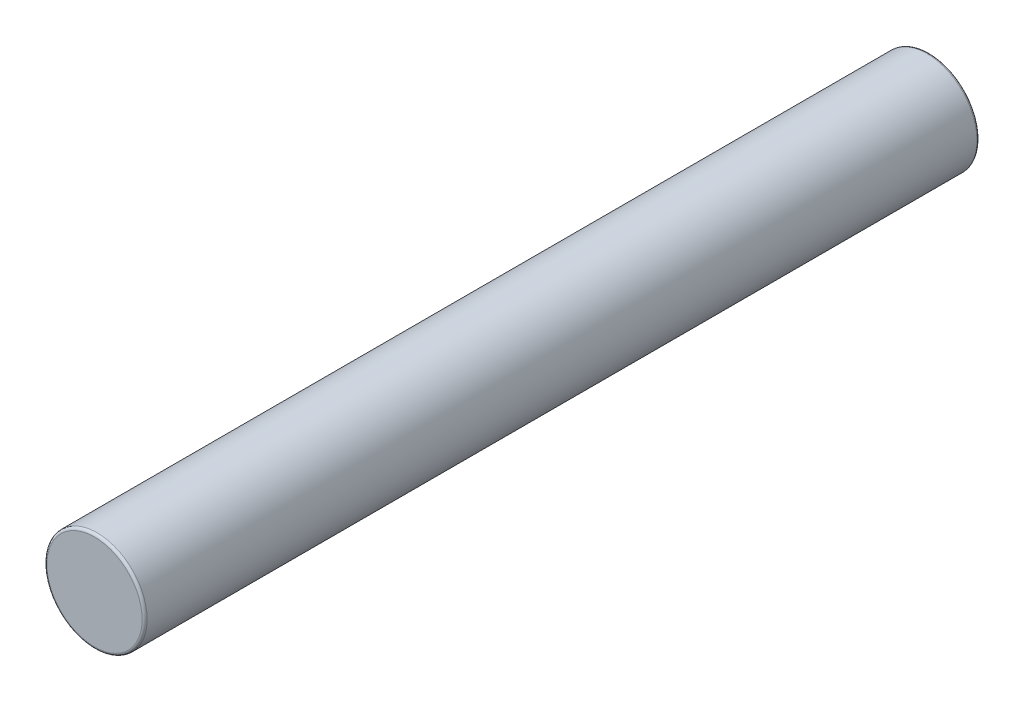
ISO-10303-21;
HEADER;
FILE_DESCRIPTION(('STEP AP214'),'2;1');
FILE_NAME('part.step','',(''),(''),'','','');
FILE_SCHEMA(('AUTOMOTIVE_DESIGN { 1 0 10303 214 1 1 1 1 }'));
ENDSEC;
DATA;
#1=APPLICATION_CONTEXT('core data for automotive mechanical design processes');
#2=APPLICATION_PROTOCOL_DEFINITION('international standard','automotive_design',2000,#1);
#3=PRODUCT_CONTEXT('',#1,'mechanical');
#4=PRODUCT('Part','Part','',(#3));
#5=PRODUCT_RELATED_PRODUCT_CATEGORY('part','',(#4));
#6=PRODUCT_DEFINITION_FORMATION('','',#4);
#7=PRODUCT_DEFINITION_CONTEXT('part definition',#1,'design');
#8=PRODUCT_DEFINITION('design','',#6,#7);
#9=PRODUCT_DEFINITION_SHAPE('','',#8);
#10=(LENGTH_UNIT() NAMED_UNIT(*) SI_UNIT(.MILLI.,.METRE.));
#11=(NAMED_UNIT(*) PLANE_ANGLE_UNIT() SI_UNIT($,.RADIAN.));
#12=(NAMED_UNIT(*) SI_UNIT($,.STERADIAN.) SOLID_ANGLE_UNIT());
#13=UNCERTAINTY_MEASURE_WITH_UNIT(LENGTH_MEASURE(1.E-05),#10,'distance_accuracy_value','');
#14=(GEOMETRIC_REPRESENTATION_CONTEXT(3) GLOBAL_UNCERTAINTY_ASSIGNED_CONTEXT((#13)) GLOBAL_UNIT_ASSIGNED_CONTEXT((#10,
#11,#12)) REPRESENTATION_CONTEXT('',''));
#15=CARTESIAN_POINT('',(0.,0.,0.));
#16=DIRECTION('',(0.,0.,1.));
#17=DIRECTION('',(1.,0.,0.));
#18=AXIS2_PLACEMENT_3D('',#15,#16,#17);
#19=CARTESIAN_POINT('',(0.,0.,25.));
#20=DIRECTION('',(0.,0.,-1.));
#21=DIRECTION('',(-1.,0.,0.));
#22=AXIS2_PLACEMENT_3D('',#19,#20,#21);
#23=CYLINDRICAL_SURFACE('',#22,1.5);
#24=CARTESIAN_POINT('',(0.,0.,0.0749999999999987));
#25=DIRECTION('',(0.,0.,1.));
#26=DIRECTION('',(1.,0.,0.));
#27=AXIS2_PLACEMENT_3D('',#24,#25,#26);
#28=CIRCLE('',#27,1.5);
#29=CARTESIAN_POINT('',(1.5,0.,0.0749999999999987));
#30=VERTEX_POINT('',#29);
#31=EDGE_CURVE('E53',#30,#30,#28,.T.);
#32=ORIENTED_EDGE('',*,*,#31,.T.);
#33=EDGE_LOOP('',(#32));
#34=FACE_BOUND('',#33,.T.);
#35=CARTESIAN_POINT('',(0.,0.,24.925));
#36=DIRECTION('',(0.,0.,1.));
#37=DIRECTION('',(1.,0.,0.));
#38=AXIS2_PLACEMENT_3D('',#35,#36,#37);
#39=CIRCLE('',#38,1.5);
#40=CARTESIAN_POINT('',(1.5,0.,24.925));
#41=VERTEX_POINT('',#40);
#42=EDGE_CURVE('E58',#41,#41,#39,.F.);
#43=ORIENTED_EDGE('',*,*,#42,.T.);
#44=EDGE_LOOP('',(#43));
#45=FACE_BOUND('',#44,.T.);
#46=ADVANCED_FACE('F40',(#34,#45),#23,.T.);
#47=CARTESIAN_POINT('',(0.,0.,25.));
#48=DIRECTION('',(0.,0.,1.));
#49=DIRECTION('',(1.,0.,0.));
#50=AXIS2_PLACEMENT_3D('',#47,#48,#49);
#51=PLANE('',#50);
#52=CARTESIAN_POINT('',(0.,0.,25.));
#53=DIRECTION('',(0.,0.,1.));
#54=DIRECTION('',(1.,0.,0.));
#55=AXIS2_PLACEMENT_3D('',#52,#53,#54);
#56=CIRCLE('',#55,1.425);
#57=CARTESIAN_POINT('',(1.425,0.,25.));
#58=VERTEX_POINT('',#57);
#59=EDGE_CURVE('E10',#58,#58,#56,.T.);
#60=ORIENTED_EDGE('',*,*,#59,.T.);
#61=EDGE_LOOP('',(#60));
#62=FACE_BOUND('',#61,.T.);
#63=ADVANCED_FACE('F75',(#62),#51,.T.);
#64=CARTESIAN_POINT('',(0.,0.,0.));
#65=DIRECTION('',(0.,0.,1.));
#66=DIRECTION('',(1.,0.,0.));
#67=AXIS2_PLACEMENT_3D('',#64,#65,#66);
#68=PLANE('',#67);
#69=CARTESIAN_POINT('',(0.,0.,0.));
#70=DIRECTION('',(0.,0.,1.));
#71=DIRECTION('',(1.,0.,0.));
#72=AXIS2_PLACEMENT_3D('',#69,#70,#71);
#73=CIRCLE('',#72,1.425);
#74=CARTESIAN_POINT('',(1.425,0.,0.));
#75=VERTEX_POINT('',#74);
#76=EDGE_CURVE('E48',#75,#75,#73,.F.);
#77=ORIENTED_EDGE('',*,*,#76,.T.);
#78=EDGE_LOOP('',(#77));
#79=FACE_BOUND('',#78,.T.);
#80=ADVANCED_FACE('F72',(#79),#68,.F.);
#81=CARTESIAN_POINT('',(0.,0.,0.0749999999999987));
#82=DIRECTION('',(0.,0.,1.));
#83=DIRECTION('',(1.,0.,0.));
#84=AXIS2_PLACEMENT_3D('',#81,#82,#83);
#85=TOROIDAL_SURFACE('',#84,1.425,0.075);
#86=ORIENTED_EDGE('',*,*,#76,.F.);
#87=EDGE_LOOP('',(#86));
#88=FACE_BOUND('',#87,.T.);
#89=ORIENTED_EDGE('',*,*,#31,.F.);
#90=EDGE_LOOP('',(#89));
#91=FACE_BOUND('',#90,.T.);
#92=ADVANCED_FACE('F68',(#88,#91),#85,.T.);
#93=CARTESIAN_POINT('',(0.,0.,24.925));
#94=DIRECTION('',(0.,0.,1.));
#95=DIRECTION('',(1.,0.,0.));
#96=AXIS2_PLACEMENT_3D('',#93,#94,#95);
#97=TOROIDAL_SURFACE('',#96,1.425,0.075);
#98=ORIENTED_EDGE('',*,*,#42,.F.);
#99=EDGE_LOOP('',(#98));
#100=FACE_BOUND('',#99,.T.);
#101=ORIENTED_EDGE('',*,*,#59,.F.);
#102=EDGE_LOOP('',(#101));
#103=FACE_BOUND('',#102,.T.);
#104=ADVANCED_FACE('F42',(#100,#103),#97,.T.);
#105=CLOSED_SHELL('',(#46,#63,#80,#92,#104));
#106=MANIFOLD_SOLID_BREP('B2',#105);
#107=ADVANCED_BREP_SHAPE_REPRESENTATION('',(#18,#106),#14);
#108=SHAPE_DEFINITION_REPRESENTATION(#9,#107);
ENDSEC;
END-ISO-10303-21;
